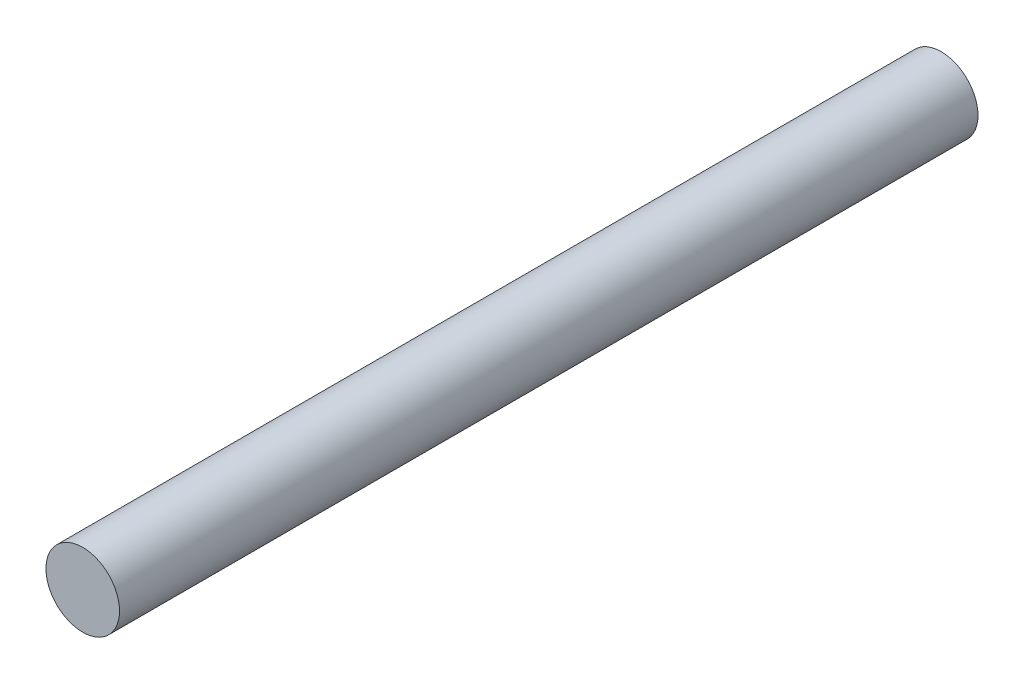
ISO-10303-21;
HEADER;
FILE_DESCRIPTION(('STEP AP214'),'2;1');
FILE_NAME('part.step','',(''),(''),'','','');
FILE_SCHEMA(('AUTOMOTIVE_DESIGN { 1 0 10303 214 1 1 1 1 }'));
ENDSEC;
DATA;
#1=APPLICATION_CONTEXT('core data for automotive mechanical design processes');
#2=APPLICATION_PROTOCOL_DEFINITION('international standard','automotive_design',2000,#1);
#3=PRODUCT_CONTEXT('',#1,'mechanical');
#4=PRODUCT('Part','Part','',(#3));
#5=PRODUCT_RELATED_PRODUCT_CATEGORY('part','',(#4));
#6=PRODUCT_DEFINITION_FORMATION('','',#4);
#7=PRODUCT_DEFINITION_CONTEXT('part definition',#1,'design');
#8=PRODUCT_DEFINITION('design','',#6,#7);
#9=PRODUCT_DEFINITION_SHAPE('','',#8);
#10=(LENGTH_UNIT() NAMED_UNIT(*) SI_UNIT(.MILLI.,.METRE.));
#11=(NAMED_UNIT(*) PLANE_ANGLE_UNIT() SI_UNIT($,.RADIAN.));
#12=(NAMED_UNIT(*) SI_UNIT($,.STERADIAN.) SOLID_ANGLE_UNIT());
#13=UNCERTAINTY_MEASURE_WITH_UNIT(LENGTH_MEASURE(1.E-05),#10,'distance_accuracy_value','');
#14=(GEOMETRIC_REPRESENTATION_CONTEXT(3) GLOBAL_UNCERTAINTY_ASSIGNED_CONTEXT((#13)) GLOBAL_UNIT_ASSIGNED_CONTEXT((#10,
#11,#12)) REPRESENTATION_CONTEXT('',''));
#15=CARTESIAN_POINT('',(0.,0.,0.));
#16=DIRECTION('',(0.,0.,1.));
#17=DIRECTION('',(1.,0.,0.));
#18=AXIS2_PLACEMENT_3D('',#15,#16,#17);
#19=CARTESIAN_POINT('',(0.,0.,35.));
#20=DIRECTION('',(0.,0.,-1.));
#21=DIRECTION('',(-1.,0.,0.));
#22=AXIS2_PLACEMENT_3D('',#19,#20,#21);
#23=CYLINDRICAL_SURFACE('',#22,1.5);
#24=CARTESIAN_POINT('',(0.,0.,35.));
#25=DIRECTION('',(0.,0.,1.));
#26=DIRECTION('',(1.,0.,0.));
#27=AXIS2_PLACEMENT_3D('',#24,#25,#26);
#28=CIRCLE('',#27,1.5);
#29=CARTESIAN_POINT('',(1.5,0.,35.));
#30=VERTEX_POINT('',#29);
#31=EDGE_CURVE('E10',#30,#30,#28,.T.);
#32=ORIENTED_EDGE('',*,*,#31,.F.);
#33=EDGE_LOOP('',(#32));
#34=FACE_BOUND('',#33,.T.);
#35=CARTESIAN_POINT('',(0.,0.,0.));
#36=DIRECTION('',(0.,0.,1.));
#37=DIRECTION('',(1.,0.,0.));
#38=AXIS2_PLACEMENT_3D('',#35,#36,#37);
#39=CIRCLE('',#38,1.5);
#40=CARTESIAN_POINT('',(1.5,0.,0.));
#41=VERTEX_POINT('',#40);
#42=EDGE_CURVE('E34',#41,#41,#39,.T.);
#43=ORIENTED_EDGE('',*,*,#42,.T.);
#44=EDGE_LOOP('',(#43));
#45=FACE_BOUND('',#44,.T.);
#46=ADVANCED_FACE('F31',(#34,#45),#23,.T.);
#47=CARTESIAN_POINT('',(0.,0.,35.));
#48=DIRECTION('',(0.,0.,1.));
#49=DIRECTION('',(1.,0.,0.));
#50=AXIS2_PLACEMENT_3D('',#47,#48,#49);
#51=PLANE('',#50);
#52=ORIENTED_EDGE('',*,*,#31,.T.);
#53=EDGE_LOOP('',(#52));
#54=FACE_BOUND('',#53,.T.);
#55=ADVANCED_FACE('F46',(#54),#51,.T.);
#56=CARTESIAN_POINT('',(0.,0.,0.));
#57=DIRECTION('',(0.,0.,1.));
#58=DIRECTION('',(1.,0.,0.));
#59=AXIS2_PLACEMENT_3D('',#56,#57,#58);
#60=PLANE('',#59);
#61=ORIENTED_EDGE('',*,*,#42,.F.);
#62=EDGE_LOOP('',(#61));
#63=FACE_BOUND('',#62,.T.);
#64=ADVANCED_FACE('F44',(#63),#60,.F.);
#65=CLOSED_SHELL('',(#46,#55,#64));
#66=MANIFOLD_SOLID_BREP('B2',#65);
#67=ADVANCED_BREP_SHAPE_REPRESENTATION('',(#18,#66),#14);
#68=SHAPE_DEFINITION_REPRESENTATION(#9,#67);
ENDSEC;
END-ISO-10303-21;
